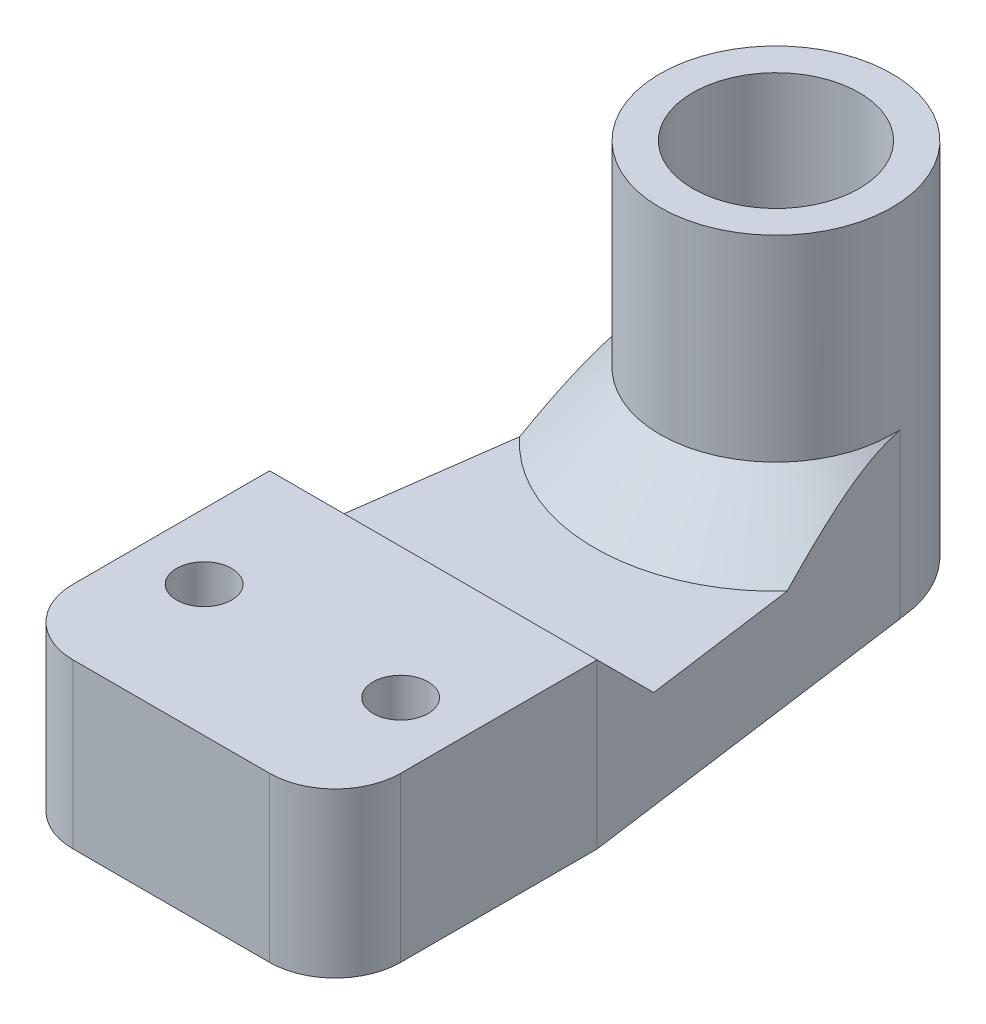
ISO-10303-21;
HEADER;
FILE_DESCRIPTION(('STEP AP214'),'2;1');
FILE_NAME('part.step','',(''),(''),'','','');
FILE_SCHEMA(('AUTOMOTIVE_DESIGN { 1 0 10303 214 1 1 1 1 }'));
ENDSEC;
DATA;
#1=APPLICATION_CONTEXT('core data for automotive mechanical design processes');
#2=APPLICATION_PROTOCOL_DEFINITION('international standard','automotive_design',2000,#1);
#3=PRODUCT_CONTEXT('',#1,'mechanical');
#4=PRODUCT('Part','Part','',(#3));
#5=PRODUCT_RELATED_PRODUCT_CATEGORY('part','',(#4));
#6=PRODUCT_DEFINITION_FORMATION('','',#4);
#7=PRODUCT_DEFINITION_CONTEXT('part definition',#1,'design');
#8=PRODUCT_DEFINITION('design','',#6,#7);
#9=PRODUCT_DEFINITION_SHAPE('','',#8);
#10=(LENGTH_UNIT() NAMED_UNIT(*) SI_UNIT(.MILLI.,.METRE.));
#11=(NAMED_UNIT(*) PLANE_ANGLE_UNIT() SI_UNIT($,.RADIAN.));
#12=(NAMED_UNIT(*) SI_UNIT($,.STERADIAN.) SOLID_ANGLE_UNIT());
#13=UNCERTAINTY_MEASURE_WITH_UNIT(LENGTH_MEASURE(1.E-05),#10,'distance_accuracy_value','');
#14=(GEOMETRIC_REPRESENTATION_CONTEXT(3) GLOBAL_UNCERTAINTY_ASSIGNED_CONTEXT((#13)) GLOBAL_UNIT_ASSIGNED_CONTEXT((#10,
#11,#12)) REPRESENTATION_CONTEXT('',''));
#15=CARTESIAN_POINT('',(0.,0.,0.));
#16=DIRECTION('',(0.,0.,1.));
#17=DIRECTION('',(1.,0.,0.));
#18=AXIS2_PLACEMENT_3D('',#15,#16,#17);
#19=CARTESIAN_POINT('',(0.,0.,0.));
#20=DIRECTION('',(0.,1.,0.));
#21=DIRECTION('',(0.,0.,1.));
#22=AXIS2_PLACEMENT_3D('',#19,#20,#21);
#23=PLANE('',#22);
#24=DIRECTION('',(0.13519099303907,0.,-0.990819557437736));
#25=VECTOR('',#24,1.);
#26=CARTESIAN_POINT('',(-13.6110412414393,0.,-1.85713954464565));
#27=LINE('',#26,#25);
#28=CARTESIAN_POINT('',(-11.8177819713779,0.,-15.));
#29=VERTEX_POINT('',#28);
#30=CARTESIAN_POINT('',(-10.2090289673038,0.,-26.7906075226674));
#31=VERTEX_POINT('',#30);
#32=EDGE_CURVE('E198',#29,#31,#27,.T.);
#33=ORIENTED_EDGE('',*,*,#32,.F.);
#34=DIRECTION('',(1.,0.,0.));
#35=VECTOR('',#34,1.);
#36=CARTESIAN_POINT('',(12.5,0.,-15.));
#37=LINE('',#36,#35);
#38=CARTESIAN_POINT('',(11.8177819713779,0.,-15.));
#39=VERTEX_POINT('',#38);
#40=EDGE_CURVE('E228',#29,#39,#37,.T.);
#41=ORIENTED_EDGE('',*,*,#40,.T.);
#42=DIRECTION('',(-0.135190993039071,0.,-0.990819557437735));
#43=VECTOR('',#42,1.);
#44=CARTESIAN_POINT('',(13.6110412414393,0.,-1.85713954464565));
#45=LINE('',#44,#43);
#46=CARTESIAN_POINT('',(10.2090289673038,0.,-26.7906075226674));
#47=VERTEX_POINT('',#46);
#48=EDGE_CURVE('E161',#39,#47,#45,.T.);
#49=ORIENTED_EDGE('',*,*,#48,.T.);
#50=CARTESIAN_POINT('',(0.,0.,-36.15));
#51=DIRECTION('',(0.,1.,0.));
#52=DIRECTION('',(0.,0.,1.));
#53=AXIS2_PLACEMENT_3D('',#50,#51,#52);
#54=CIRCLE('',#53,13.85);
#55=EDGE_CURVE('E225',#47,#31,#54,.F.);
#56=ORIENTED_EDGE('',*,*,#55,.T.);
#57=EDGE_LOOP('',(#33,#41,#49,#56));
#58=FACE_BOUND('',#57,.T.);
#59=ADVANCED_FACE('F47',(#58),#23,.T.);
#60=CARTESIAN_POINT('',(8.85000000000001,-7.5,0.));
#61=DIRECTION('',(1.,0.,0.));
#62=DIRECTION('',(0.,0.,-1.));
#63=AXIS2_PLACEMENT_3D('',#60,#61,#62);
#64=PLANE('',#63);
#65=DIRECTION('',(0.,1.,0.));
#66=VECTOR('',#65,1.);
#67=CARTESIAN_POINT('',(8.85,-7.5,-36.15));
#68=LINE('',#67,#66);
#69=CARTESIAN_POINT('',(8.85,-7.5,-36.15));
#70=VERTEX_POINT('',#69);
#71=CARTESIAN_POINT('',(8.85,5.00000000000004,-36.15));
#72=VERTEX_POINT('',#71);
#73=EDGE_CURVE('E139',#70,#72,#68,.T.);
#74=ORIENTED_EDGE('',*,*,#73,.T.);
#75=CARTESIAN_POINT('',(8.85,5.00000000000004,-36.15));
#76=CARTESIAN_POINT('',(8.85,4.999993165204,-36.2502781368476));
#77=CARTESIAN_POINT('',(8.85,4.9982912530021,-36.3504987858993));
#78=CARTESIAN_POINT('',(8.85,4.99149727602525,-36.5508250424022));
#79=CARTESIAN_POINT('',(8.85,4.98640521348442,-36.6509306499294));
#80=CARTESIAN_POINT('',(8.85,4.97961807577188,-36.7509787697362));
#81=B_SPLINE_CURVE_WITH_KNOTS('',3,(#75,#76,#77,#78,#79,#80),.UNSPECIFIED.,.F.,.F.,(4,2,4),(0.,
0.300705295951448,0.601410393736025),.UNSPECIFIED.);
#82=CARTESIAN_POINT('',(8.85,4.97961807577188,-36.7509787697362));
#83=VERTEX_POINT('',#82);
#84=EDGE_CURVE('E241',#72,#83,#81,.T.);
#85=ORIENTED_EDGE('',*,*,#84,.T.);
#86=DIRECTION('',(0.,1.,0.));
#87=VECTOR('',#86,1.);
#88=CARTESIAN_POINT('',(8.85,-7.5,-36.7509787697362));
#89=LINE('',#88,#87);
#90=CARTESIAN_POINT('',(8.85,-7.5,-36.7509787697362));
#91=VERTEX_POINT('',#90);
#92=EDGE_CURVE('E157',#91,#83,#89,.T.);
#93=ORIENTED_EDGE('',*,*,#92,.F.);
#94=DIRECTION('',(0.,0.,-1.));
#95=VECTOR('',#94,1.);
#96=CARTESIAN_POINT('',(8.85000000000001,-7.5,0.));
#97=LINE('',#96,#95);
#98=EDGE_CURVE('E155',#70,#91,#97,.T.);
#99=ORIENTED_EDGE('',*,*,#98,.F.);
#100=EDGE_LOOP('',(#74,#85,#93,#99));
#101=FACE_BOUND('',#100,.T.);
#102=ADVANCED_FACE('F156',(#101),#64,.F.);
#103=CARTESIAN_POINT('',(13.6110412414393,-7.5,-1.85713954464565));
#104=DIRECTION('',(0.990819557437735,0.,-0.135190993039071));
#105=DIRECTION('',(-0.135190993039071,0.,-0.990819557437735));
#106=AXIS2_PLACEMENT_3D('',#103,#104,#105);
#107=PLANE('',#106);
#108=ORIENTED_EDGE('',*,*,#48,.F.);
#109=DIRECTION('',(-0.0960342700961743,-0.70383855356434,-0.703838553564348));
#110=VECTOR('',#109,1.);
#111=CARTESIAN_POINT('',(11.7087915195177,-0.798794866799206,-15.7987948667993));
#112=LINE('',#111,#110);
#113=CARTESIAN_POINT('',(12.5,5.,-10.));
#114=VERTEX_POINT('',#113);
#115=EDGE_CURVE('E234',#39,#114,#112,.F.);
#116=ORIENTED_EDGE('',*,*,#115,.T.);
#117=DIRECTION('',(0.,1.,0.));
#118=VECTOR('',#117,1.);
#119=CARTESIAN_POINT('',(12.5,-7.5,-10.));
#120=LINE('',#119,#118);
#121=CARTESIAN_POINT('',(12.5,-7.5,-10.));
#122=VERTEX_POINT('',#121);
#123=EDGE_CURVE('E209',#122,#114,#120,.T.);
#124=ORIENTED_EDGE('',*,*,#123,.F.);
#125=DIRECTION('',(-0.135190993039071,0.,-0.990819557437735));
#126=VECTOR('',#125,1.);
#127=CARTESIAN_POINT('',(13.6110412414393,-7.5,-1.85713954464565));
#128=LINE('',#127,#126);
#129=EDGE_CURVE('E188',#122,#91,#128,.T.);
#130=ORIENTED_EDGE('',*,*,#129,.T.);
#131=ORIENTED_EDGE('',*,*,#92,.T.);
#132=CARTESIAN_POINT('',(8.85,4.97961807577188,-36.7509787697362));
#133=CARTESIAN_POINT('',(8.86952521616639,4.96984985447064,-36.6078777716152));
#134=CARTESIAN_POINT('',(8.88901632843545,4.95655418855607,-36.4650267221609));
#135=CARTESIAN_POINT('',(8.92788726488935,4.92319907208714,-36.1801402575478));
#136=CARTESIAN_POINT('',(8.94726711852058,4.9031415038799,-36.0381046265753));
#137=CARTESIAN_POINT('',(8.98583687606921,4.8566040220541,-35.7554255127842));
#138=CARTESIAN_POINT('',(9.00502712496709,4.83013968670678,-35.6147795015916));
#139=CARTESIAN_POINT('',(9.04323620560288,4.77114222174539,-35.3347438016192));
#140=CARTESIAN_POINT('',(9.06225502569041,4.73860868287692,-35.1953541982255));
#141=CARTESIAN_POINT('',(9.1184640872157,4.63355680832067,-34.7833960032858));
#142=CARTESIAN_POINT('',(9.15537901724246,4.55287240549804,-34.5128451787839));
#143=CARTESIAN_POINT('',(9.2283721994417,4.37286550246867,-33.9778755712915));
#144=CARTESIAN_POINT('',(9.26445004121688,4.27353406846279,-33.7134597961173));
#145=CARTESIAN_POINT('',(9.34072757063575,4.04453011645242,-33.1544190919825));
#146=CARTESIAN_POINT('',(9.38080033336595,3.91255810320771,-32.8607244001906));
#147=CARTESIAN_POINT('',(9.45992034469864,3.63264599769134,-32.2808510458284));
#148=CARTESIAN_POINT('',(9.49896719154791,3.48469976239443,-31.9946753277215));
#149=CARTESIAN_POINT('',(9.57622716368897,3.17576073104443,-31.4284342662159));
#150=CARTESIAN_POINT('',(9.61443793517536,3.01473593913031,-31.1483861739397));
#151=CARTESIAN_POINT('',(9.69003488947677,2.68256330808689,-30.5943334288511));
#152=CARTESIAN_POINT('',(9.72742118330014,2.51141684331428,-30.3203279624543));
#153=CARTESIAN_POINT('',(9.80288342377384,2.15435470082208,-29.7672625397615));
#154=CARTESIAN_POINT('',(9.84093213963402,1.96812539066234,-29.4884021588872));
#155=CARTESIAN_POINT('',(9.91637997961569,1.5885716997897,-28.9354422779086));
#156=CARTESIAN_POINT('',(9.95377904373629,1.39524666880556,-28.6613432175529));
#157=CARTESIAN_POINT('',(10.0277589863378,1.00421553891466,-28.1191416082598));
#158=CARTESIAN_POINT('',(10.0643437625123,0.806549651450251,-27.8510104929886));
#159=CARTESIAN_POINT('',(10.1370284065109,0.406550081628088,-27.3183021728539));
#160=CARTESIAN_POINT('',(10.1731284084791,0.204217734493121,-27.0537239848429));
#161=CARTESIAN_POINT('',(10.2090289673038,0.,-26.7906075226674));
#162=B_SPLINE_CURVE_WITH_KNOTS('',3,(#132,#133,#134,#135,#136,#137,#138,#139,#140,#141,#142,
#143,#144,#145,#146,#147,#148,#149,#150,#151,#152,#153,#154,#155,#156,#157,#158,#159,#160,#161),
.UNSPECIFIED.,.F.,.F.,(4,2,2,2,2,2,2,2,2,2,2,2,2,2,4),(0.,0.434207308821548,0.868293844690426,
1.3013353025838,1.73440597159573,2.58771199176812,3.44142787936809,4.41421394646207,
5.38737544828286,6.36299390951703,7.33848020061623,8.35078532667936,9.36318345592189,
10.368484653598,11.3735016863097),.UNSPECIFIED.);
#163=EDGE_CURVE('E250',#83,#47,#162,.T.);
#164=ORIENTED_EDGE('',*,*,#163,.T.);
#165=EDGE_LOOP('',(#108,#116,#124,#130,#131,#164));
#166=FACE_BOUND('',#165,.T.);
#167=ADVANCED_FACE('F320',(#166),#107,.T.);
#168=CARTESIAN_POINT('',(12.5,-7.5,0.));
#169=DIRECTION('',(1.,0.,0.));
#170=DIRECTION('',(0.,0.,-1.));
#171=AXIS2_PLACEMENT_3D('',#168,#169,#170);
#172=PLANE('',#171);
#173=DIRECTION('',(0.,0.,-1.));
#174=VECTOR('',#173,1.);
#175=CARTESIAN_POINT('',(12.5,5.,0.));
#176=LINE('',#175,#174);
#177=CARTESIAN_POINT('',(12.5,5.,5.));
#178=VERTEX_POINT('',#177);
#179=EDGE_CURVE('E497',#178,#114,#176,.T.);
#180=ORIENTED_EDGE('',*,*,#179,.F.);
#181=DIRECTION('',(0.,1.,0.));
#182=VECTOR('',#181,1.);
#183=CARTESIAN_POINT('',(12.5,-7.5,5.));
#184=LINE('',#183,#182);
#185=CARTESIAN_POINT('',(12.5,-7.5,5.));
#186=VERTEX_POINT('',#185);
#187=EDGE_CURVE('E71',#178,#186,#184,.F.);
#188=ORIENTED_EDGE('',*,*,#187,.T.);
#189=DIRECTION('',(0.,0.,-1.));
#190=VECTOR('',#189,1.);
#191=CARTESIAN_POINT('',(12.5,-7.5,0.));
#192=LINE('',#191,#190);
#193=EDGE_CURVE('E185',#186,#122,#192,.T.);
#194=ORIENTED_EDGE('',*,*,#193,.T.);
#195=ORIENTED_EDGE('',*,*,#123,.T.);
#196=EDGE_LOOP('',(#180,#188,#194,#195));
#197=FACE_BOUND('',#196,.T.);
#198=ADVANCED_FACE('F452',(#197),#172,.T.);
#199=CARTESIAN_POINT('',(0.,-7.5,10.));
#200=DIRECTION('',(0.,0.,1.));
#201=DIRECTION('',(1.,0.,0.));
#202=AXIS2_PLACEMENT_3D('',#199,#200,#201);
#203=PLANE('',#202);
#204=DIRECTION('',(1.,0.,0.));
#205=VECTOR('',#204,1.);
#206=CARTESIAN_POINT('',(0.,-7.5,10.));
#207=LINE('',#206,#205);
#208=CARTESIAN_POINT('',(-7.5,-7.5,10.));
#209=VERTEX_POINT('',#208);
#210=CARTESIAN_POINT('',(7.5,-7.5,10.));
#211=VERTEX_POINT('',#210);
#212=EDGE_CURVE('E181',#209,#211,#207,.T.);
#213=ORIENTED_EDGE('',*,*,#212,.T.);
#214=DIRECTION('',(0.,1.,0.));
#215=VECTOR('',#214,1.);
#216=CARTESIAN_POINT('',(7.5,-7.5,10.));
#217=LINE('',#216,#215);
#218=CARTESIAN_POINT('',(7.5,5.,10.));
#219=VERTEX_POINT('',#218);
#220=EDGE_CURVE('E542',#211,#219,#217,.T.);
#221=ORIENTED_EDGE('',*,*,#220,.T.);
#222=DIRECTION('',(1.,0.,0.));
#223=VECTOR('',#222,1.);
#224=CARTESIAN_POINT('',(0.,5.,10.));
#225=LINE('',#224,#223);
#226=CARTESIAN_POINT('',(-7.5,5.,10.));
#227=VERTEX_POINT('',#226);
#228=EDGE_CURVE('E502',#227,#219,#225,.T.);
#229=ORIENTED_EDGE('',*,*,#228,.F.);
#230=DIRECTION('',(0.,1.,0.));
#231=VECTOR('',#230,1.);
#232=CARTESIAN_POINT('',(-7.5,-7.5,10.));
#233=LINE('',#232,#231);
#234=EDGE_CURVE('E540',#227,#209,#233,.F.);
#235=ORIENTED_EDGE('',*,*,#234,.T.);
#236=EDGE_LOOP('',(#213,#221,#229,#235));
#237=FACE_BOUND('',#236,.T.);
#238=ADVANCED_FACE('F445',(#237),#203,.T.);
#239=CARTESIAN_POINT('',(-12.5,-7.5,0.));
#240=DIRECTION('',(1.,0.,0.));
#241=DIRECTION('',(0.,0.,-1.));
#242=AXIS2_PLACEMENT_3D('',#239,#240,#241);
#243=PLANE('',#242);
#244=DIRECTION('',(0.,0.,-1.));
#245=VECTOR('',#244,1.);
#246=CARTESIAN_POINT('',(-12.5,-7.5,0.));
#247=LINE('',#246,#245);
#248=CARTESIAN_POINT('',(-12.5,-7.5,5.));
#249=VERTEX_POINT('',#248);
#250=CARTESIAN_POINT('',(-12.5,-7.5,-10.));
#251=VERTEX_POINT('',#250);
#252=EDGE_CURVE('E178',#249,#251,#247,.T.);
#253=ORIENTED_EDGE('',*,*,#252,.F.);
#254=DIRECTION('',(0.,1.,0.));
#255=VECTOR('',#254,1.);
#256=CARTESIAN_POINT('',(-12.5,5.,5.));
#257=LINE('',#256,#255);
#258=CARTESIAN_POINT('',(-12.5,5.,5.));
#259=VERTEX_POINT('',#258);
#260=EDGE_CURVE('E11',#249,#259,#257,.T.);
#261=ORIENTED_EDGE('',*,*,#260,.T.);
#262=DIRECTION('',(0.,0.,-1.));
#263=VECTOR('',#262,1.);
#264=CARTESIAN_POINT('',(-12.5,5.,0.));
#265=LINE('',#264,#263);
#266=CARTESIAN_POINT('',(-12.5,4.99999999999998,-10.));
#267=VERTEX_POINT('',#266);
#268=EDGE_CURVE('E202',#259,#267,#265,.T.);
#269=ORIENTED_EDGE('',*,*,#268,.T.);
#270=DIRECTION('',(0.,1.,0.));
#271=VECTOR('',#270,1.);
#272=CARTESIAN_POINT('',(-12.5,-7.5,-10.));
#273=LINE('',#272,#271);
#274=EDGE_CURVE('E213',#251,#267,#273,.T.);
#275=ORIENTED_EDGE('',*,*,#274,.F.);
#276=EDGE_LOOP('',(#253,#261,#269,#275));
#277=FACE_BOUND('',#276,.T.);
#278=ADVANCED_FACE('F294',(#277),#243,.F.);
#279=CARTESIAN_POINT('',(-13.6110412414393,-7.5,-1.85713954464565));
#280=DIRECTION('',(0.990819557437735,0.,0.13519099303907));
#281=DIRECTION('',(0.13519099303907,0.,-0.990819557437736));
#282=AXIS2_PLACEMENT_3D('',#279,#280,#281);
#283=PLANE('',#282);
#284=ORIENTED_EDGE('',*,*,#274,.T.);
#285=DIRECTION('',(-0.096034270096174,0.70383855356434,0.703838553564348));
#286=VECTOR('',#285,1.);
#287=CARTESIAN_POINT('',(-12.215736182696,2.91662045432747,-12.0833795456725));
#288=LINE('',#287,#286);
#289=EDGE_CURVE('E238',#267,#29,#288,.F.);
#290=ORIENTED_EDGE('',*,*,#289,.T.);
#291=ORIENTED_EDGE('',*,*,#32,.T.);
#292=CARTESIAN_POINT('',(-10.2090289673038,0.,-26.7906075226674));
#293=CARTESIAN_POINT('',(-10.1719667494186,0.21082003046292,-27.0622378250805));
#294=CARTESIAN_POINT('',(-10.1346922964825,0.419636550061856,-27.3354236056686));
#295=CARTESIAN_POINT('',(-10.0596230828301,0.832272462849694,-27.8856085209223));
#296=CARTESIAN_POINT('',(-10.0218281571344,1.03609021181526,-28.1626088647274));
#297=CARTESIAN_POINT('',(-9.94532241247762,1.43930626853286,-28.7233221663924));
#298=CARTESIAN_POINT('',(-9.90660653962085,1.6386523000143,-29.0070721644316));
#299=CARTESIAN_POINT('',(-9.82847004404595,2.02960114475368,-29.5797372971072));
#300=CARTESIAN_POINT('',(-9.78904949727667,2.22120478530518,-29.8686518751117));
#301=CARTESIAN_POINT('',(-9.71092855045548,2.58747275761064,-30.4412030504227));
#302=CARTESIAN_POINT('',(-9.67225991741696,2.76250620311102,-30.7246068261674));
#303=CARTESIAN_POINT('',(-9.59402438335674,3.10140975916726,-31.2979978153959));
#304=CARTESIAN_POINT('',(-9.55445733501205,3.26527802096057,-31.5879861086151));
#305=CARTESIAN_POINT('',(-9.4744304231143,3.57836546959044,-32.1745061692134));
#306=CARTESIAN_POINT('',(-9.43397377129329,3.72762925560616,-32.4710143976952));
#307=CARTESIAN_POINT('',(-9.35195006572219,4.00826534109267,-33.0721690295713));
#308=CARTESIAN_POINT('',(-9.31038355311133,4.13964617594109,-33.3768114669371));
#309=CARTESIAN_POINT('',(-9.2349579999634,4.35457752659846,-33.929608006925));
#310=CARTESIAN_POINT('',(-9.20132081600815,4.4423729236317,-34.176136114832));
#311=CARTESIAN_POINT('',(-9.13333241458266,4.60131087605998,-34.6744255074681));
#312=CARTESIAN_POINT('',(-9.09898139834427,4.67245805712626,-34.9261853173618));
#313=CARTESIAN_POINT('',(-9.0467422914763,4.76513394956592,-35.3090475745604));
#314=CARTESIAN_POINT('',(-9.02908349540233,4.79383639917096,-35.438469513978));
#315=CARTESIAN_POINT('',(-8.99362377657189,4.84595998849557,-35.6983550442831));
#316=CARTESIAN_POINT('',(-8.97582286132601,4.86938140541417,-35.8288185801254));
#317=CARTESIAN_POINT('',(-8.94006934843534,4.91069002389312,-36.0908573374629));
#318=CARTESIAN_POINT('',(-8.92211652840569,4.92856672922279,-36.2224341888246));
#319=CARTESIAN_POINT('',(-8.88611880171843,4.95850878395154,-36.486262797693));
#320=CARTESIAN_POINT('',(-8.86807387601962,4.97057287808505,-36.6185146947533));
#321=CARTESIAN_POINT('',(-8.85,4.97961807577188,-36.7509787697363));
#322=B_SPLINE_CURVE_WITH_KNOTS('',3,(#292,#293,#294,#295,#296,#297,#298,#299,#300,#301,#302,
#303,#304,#305,#306,#307,#308,#309,#310,#311,#312,#313,#314,#315,#316,#317,#318,#319,#320,#321),
.UNSPECIFIED.,.F.,.F.,(4,2,2,2,2,2,2,2,2,2,2,2,2,2,4),(0.,1.03752964090692,2.07539609508894,
3.12208246422732,4.16865669499738,5.17446164289494,6.18043273209296,7.18322905917604,
8.18554506926123,8.97662233849651,9.76747954691829,10.168601559327,10.569702512117,
10.9715581856931,11.3735006033729),.UNSPECIFIED.);
#323=CARTESIAN_POINT('',(-8.85,4.97961807577188,-36.7509787697362));
#324=VERTEX_POINT('',#323);
#325=EDGE_CURVE('E274',#31,#324,#322,.T.);
#326=ORIENTED_EDGE('',*,*,#325,.T.);
#327=DIRECTION('',(0.,1.,0.));
#328=VECTOR('',#327,1.);
#329=CARTESIAN_POINT('',(-8.85,-7.5,-36.7509787697362));
#330=LINE('',#329,#328);
#331=CARTESIAN_POINT('',(-8.85,-7.5,-36.7509787697362));
#332=VERTEX_POINT('',#331);
#333=EDGE_CURVE('E217',#332,#324,#330,.T.);
#334=ORIENTED_EDGE('',*,*,#333,.F.);
#335=DIRECTION('',(0.13519099303907,0.,-0.990819557437736));
#336=VECTOR('',#335,1.);
#337=CARTESIAN_POINT('',(-13.6110412414393,-7.5,-1.85713954464565));
#338=LINE('',#337,#336);
#339=EDGE_CURVE('E172',#251,#332,#338,.T.);
#340=ORIENTED_EDGE('',*,*,#339,.F.);
#341=EDGE_LOOP('',(#284,#290,#291,#326,#334,#340));
#342=FACE_BOUND('',#341,.T.);
#343=ADVANCED_FACE('F289',(#342),#283,.F.);
#344=CARTESIAN_POINT('',(-8.85,-7.5,0.));
#345=DIRECTION('',(1.,0.,0.));
#346=DIRECTION('',(0.,0.,-1.));
#347=AXIS2_PLACEMENT_3D('',#344,#345,#346);
#348=PLANE('',#347);
#349=ORIENTED_EDGE('',*,*,#333,.T.);
#350=CARTESIAN_POINT('',(-8.85,4.97961807577188,-36.7509787697362));
#351=CARTESIAN_POINT('',(-8.85,4.98640521348442,-36.6509306499294));
#352=CARTESIAN_POINT('',(-8.85,4.99149727602525,-36.5508250424023));
#353=CARTESIAN_POINT('',(-8.85,4.9982912530021,-36.3504987858993));
#354=CARTESIAN_POINT('',(-8.85,4.999993165204,-36.2502781368477));
#355=CARTESIAN_POINT('',(-8.85,5.00000000000004,-36.15));
#356=B_SPLINE_CURVE_WITH_KNOTS('',3,(#350,#351,#352,#353,#354,#355),.UNSPECIFIED.,.F.,.F.,(4,2,
4),(0.,0.300705097784598,0.601410393736067),.UNSPECIFIED.);
#357=CARTESIAN_POINT('',(-8.85,5.00000000000004,-36.15));
#358=VERTEX_POINT('',#357);
#359=EDGE_CURVE('E282',#324,#358,#356,.T.);
#360=ORIENTED_EDGE('',*,*,#359,.T.);
#361=DIRECTION('',(0.,1.,0.));
#362=VECTOR('',#361,1.);
#363=CARTESIAN_POINT('',(-8.85,-7.5,-36.15));
#364=LINE('',#363,#362);
#365=CARTESIAN_POINT('',(-8.85,-7.5,-36.15));
#366=VERTEX_POINT('',#365);
#367=EDGE_CURVE('E151',#366,#358,#364,.T.);
#368=ORIENTED_EDGE('',*,*,#367,.F.);
#369=DIRECTION('',(0.,0.,-1.));
#370=VECTOR('',#369,1.);
#371=CARTESIAN_POINT('',(-8.85,-7.5,0.));
#372=LINE('',#371,#370);
#373=EDGE_CURVE('E167',#366,#332,#372,.T.);
#374=ORIENTED_EDGE('',*,*,#373,.T.);
#375=EDGE_LOOP('',(#349,#360,#368,#374));
#376=FACE_BOUND('',#375,.T.);
#377=ADVANCED_FACE('F293',(#376),#348,.T.);
#378=CARTESIAN_POINT('',(7.5,-7.5,0.));
#379=DIRECTION('',(0.,1.,0.));
#380=DIRECTION('',(0.,0.,1.));
#381=AXIS2_PLACEMENT_3D('',#378,#379,#380);
#382=CYLINDRICAL_SURFACE('',#381,2.1);
#383=CARTESIAN_POINT('',(7.5,-7.5,0.));
#384=DIRECTION('',(0.,1.,0.));
#385=DIRECTION('',(0.,0.,1.));
#386=AXIS2_PLACEMENT_3D('',#383,#384,#385);
#387=CIRCLE('',#386,2.1);
#388=CARTESIAN_POINT('',(7.5,-7.5,2.1));
#389=VERTEX_POINT('',#388);
#390=EDGE_CURVE('E191',#389,#389,#387,.T.);
#391=ORIENTED_EDGE('',*,*,#390,.F.);
#392=EDGE_LOOP('',(#391));
#393=FACE_BOUND('',#392,.T.);
#394=CARTESIAN_POINT('',(7.5,5.,0.));
#395=DIRECTION('',(0.,1.,0.));
#396=DIRECTION('',(0.,0.,1.));
#397=AXIS2_PLACEMENT_3D('',#394,#395,#396);
#398=CIRCLE('',#397,2.1);
#399=CARTESIAN_POINT('',(7.5,5.,2.1));
#400=VERTEX_POINT('',#399);
#401=EDGE_CURVE('E512',#400,#400,#398,.T.);
#402=ORIENTED_EDGE('',*,*,#401,.T.);
#403=EDGE_LOOP('',(#402));
#404=FACE_BOUND('',#403,.T.);
#405=ADVANCED_FACE('F299',(#393,#404),#382,.F.);
#406=CARTESIAN_POINT('',(0.,-7.5,-36.15));
#407=DIRECTION('',(0.,1.,0.));
#408=DIRECTION('',(0.,0.,1.));
#409=AXIS2_PLACEMENT_3D('',#406,#407,#408);
#410=CYLINDRICAL_SURFACE('',#409,8.85);
#411=CARTESIAN_POINT('',(0.,5.00000000000004,-36.15));
#412=DIRECTION('',(0.,1.,0.));
#413=DIRECTION('',(0.,0.,1.));
#414=AXIS2_PLACEMENT_3D('',#411,#412,#413);
#415=CIRCLE('',#414,8.85);
#416=EDGE_CURVE('E146',#358,#72,#415,.T.);
#417=ORIENTED_EDGE('',*,*,#416,.T.);
#418=ORIENTED_EDGE('',*,*,#73,.F.);
#419=CARTESIAN_POINT('',(0.,-7.5,-36.15));
#420=DIRECTION('',(0.,1.,0.));
#421=DIRECTION('',(0.,0.,1.));
#422=AXIS2_PLACEMENT_3D('',#419,#420,#421);
#423=CIRCLE('',#422,8.85);
#424=EDGE_CURVE('E144',#70,#366,#423,.T.);
#425=ORIENTED_EDGE('',*,*,#424,.T.);
#426=ORIENTED_EDGE('',*,*,#367,.T.);
#427=EDGE_LOOP('',(#417,#418,#425,#426));
#428=FACE_BOUND('',#427,.T.);
#429=CARTESIAN_POINT('',(0.,20.,-36.15));
#430=DIRECTION('',(0.,1.,0.));
#431=DIRECTION('',(0.,0.,1.));
#432=AXIS2_PLACEMENT_3D('',#429,#430,#431);
#433=CIRCLE('',#432,8.85);
#434=CARTESIAN_POINT('',(0.,20.,-27.3));
#435=VERTEX_POINT('',#434);
#436=EDGE_CURVE('E516',#435,#435,#433,.T.);
#437=ORIENTED_EDGE('',*,*,#436,.F.);
#438=EDGE_LOOP('',(#437));
#439=FACE_BOUND('',#438,.T.);
#440=ADVANCED_FACE('F141',(#428,#439),#410,.T.);
#441=CARTESIAN_POINT('',(-7.5,-7.5,0.));
#442=DIRECTION('',(0.,1.,0.));
#443=DIRECTION('',(0.,0.,1.));
#444=AXIS2_PLACEMENT_3D('',#441,#442,#443);
#445=CYLINDRICAL_SURFACE('',#444,2.1);
#446=CARTESIAN_POINT('',(-7.5,-7.5,0.));
#447=DIRECTION('',(0.,1.,0.));
#448=DIRECTION('',(0.,0.,1.));
#449=AXIS2_PLACEMENT_3D('',#446,#447,#448);
#450=CIRCLE('',#449,2.1);
#451=CARTESIAN_POINT('',(-7.5,-7.5,2.1));
#452=VERTEX_POINT('',#451);
#453=EDGE_CURVE('E152',#452,#452,#450,.T.);
#454=ORIENTED_EDGE('',*,*,#453,.F.);
#455=EDGE_LOOP('',(#454));
#456=FACE_BOUND('',#455,.T.);
#457=CARTESIAN_POINT('',(-7.5,5.,0.));
#458=DIRECTION('',(0.,1.,0.));
#459=DIRECTION('',(0.,0.,1.));
#460=AXIS2_PLACEMENT_3D('',#457,#458,#459);
#461=CIRCLE('',#460,2.1);
#462=CARTESIAN_POINT('',(-7.5,5.,2.1));
#463=VERTEX_POINT('',#462);
#464=EDGE_CURVE('E508',#463,#463,#461,.T.);
#465=ORIENTED_EDGE('',*,*,#464,.T.);
#466=EDGE_LOOP('',(#465));
#467=FACE_BOUND('',#466,.T.);
#468=ADVANCED_FACE('F302',(#456,#467),#445,.F.);
#469=CARTESIAN_POINT('',(0.,-7.5,0.));
#470=DIRECTION('',(0.,1.,0.));
#471=DIRECTION('',(0.,0.,1.));
#472=AXIS2_PLACEMENT_3D('',#469,#470,#471);
#473=PLANE('',#472);
#474=ORIENTED_EDGE('',*,*,#193,.F.);
#475=CARTESIAN_POINT('',(7.5,-7.5,5.));
#476=DIRECTION('',(0.,1.,0.));
#477=DIRECTION('',(0.,0.,1.));
#478=AXIS2_PLACEMENT_3D('',#475,#476,#477);
#479=CIRCLE('',#478,5.);
#480=EDGE_CURVE('E56',#186,#211,#479,.F.);
#481=ORIENTED_EDGE('',*,*,#480,.T.);
#482=ORIENTED_EDGE('',*,*,#212,.F.);
#483=CARTESIAN_POINT('',(-7.5,-7.5,5.));
#484=DIRECTION('',(0.,1.,0.));
#485=DIRECTION('',(0.,0.,1.));
#486=AXIS2_PLACEMENT_3D('',#483,#484,#485);
#487=CIRCLE('',#486,5.);
#488=EDGE_CURVE('E63',#209,#249,#487,.F.);
#489=ORIENTED_EDGE('',*,*,#488,.T.);
#490=ORIENTED_EDGE('',*,*,#252,.T.);
#491=ORIENTED_EDGE('',*,*,#339,.T.);
#492=ORIENTED_EDGE('',*,*,#373,.F.);
#493=ORIENTED_EDGE('',*,*,#424,.F.);
#494=ORIENTED_EDGE('',*,*,#98,.T.);
#495=ORIENTED_EDGE('',*,*,#129,.F.);
#496=EDGE_LOOP('',(#474,#481,#482,#489,#490,#491,#492,#493,#494,#495));
#497=FACE_BOUND('',#496,.T.);
#498=ORIENTED_EDGE('',*,*,#390,.T.);
#499=EDGE_LOOP('',(#498));
#500=FACE_BOUND('',#499,.T.);
#501=ORIENTED_EDGE('',*,*,#453,.T.);
#502=EDGE_LOOP('',(#501));
#503=FACE_BOUND('',#502,.T.);
#504=ADVANCED_FACE('F164',(#497,#500,#503),#473,.F.);
#505=CARTESIAN_POINT('',(0.,5.,0.));
#506=DIRECTION('',(0.,1.,0.));
#507=DIRECTION('',(0.,0.,1.));
#508=AXIS2_PLACEMENT_3D('',#505,#506,#507);
#509=PLANE('',#508);
#510=ORIENTED_EDGE('',*,*,#401,.F.);
#511=EDGE_LOOP('',(#510));
#512=FACE_BOUND('',#511,.T.);
#513=ORIENTED_EDGE('',*,*,#464,.F.);
#514=EDGE_LOOP('',(#513));
#515=FACE_BOUND('',#514,.T.);
#516=ORIENTED_EDGE('',*,*,#228,.T.);
#517=CARTESIAN_POINT('',(7.5,5.,5.));
#518=DIRECTION('',(0.,1.,0.));
#519=DIRECTION('',(0.,0.,1.));
#520=AXIS2_PLACEMENT_3D('',#517,#518,#519);
#521=CIRCLE('',#520,5.);
#522=EDGE_CURVE('E536',#219,#178,#521,.T.);
#523=ORIENTED_EDGE('',*,*,#522,.T.);
#524=ORIENTED_EDGE('',*,*,#179,.T.);
#525=DIRECTION('',(1.,0.,0.));
#526=VECTOR('',#525,1.);
#527=CARTESIAN_POINT('',(0.,5.,-10.));
#528=LINE('',#527,#526);
#529=EDGE_CURVE('E493',#267,#114,#528,.T.);
#530=ORIENTED_EDGE('',*,*,#529,.F.);
#531=ORIENTED_EDGE('',*,*,#268,.F.);
#532=CARTESIAN_POINT('',(-7.5,5.,5.));
#533=DIRECTION('',(0.,1.,0.));
#534=DIRECTION('',(0.,0.,1.));
#535=AXIS2_PLACEMENT_3D('',#532,#533,#534);
#536=CIRCLE('',#535,5.);
#537=EDGE_CURVE('E537',#259,#227,#536,.T.);
#538=ORIENTED_EDGE('',*,*,#537,.T.);
#539=EDGE_LOOP('',(#516,#523,#524,#530,#531,#538));
#540=FACE_BOUND('',#539,.T.);
#541=ADVANCED_FACE('F335',(#512,#515,#540),#509,.T.);
#542=CARTESIAN_POINT('',(0.,20.,-36.15));
#543=DIRECTION('',(0.,-1.,0.));
#544=DIRECTION('',(0.,0.,-1.));
#545=AXIS2_PLACEMENT_3D('',#542,#543,#544);
#546=CYLINDRICAL_SURFACE('',#545,6.35);
#547=CARTESIAN_POINT('',(0.,20.,-36.15));
#548=DIRECTION('',(0.,1.,0.));
#549=DIRECTION('',(0.,0.,1.));
#550=AXIS2_PLACEMENT_3D('',#547,#548,#549);
#551=CIRCLE('',#550,6.35);
#552=CARTESIAN_POINT('',(0.,20.,-29.8));
#553=VERTEX_POINT('',#552);
#554=EDGE_CURVE('E520',#553,#553,#551,.T.);
#555=ORIENTED_EDGE('',*,*,#554,.T.);
#556=EDGE_LOOP('',(#555));
#557=FACE_BOUND('',#556,.T.);
#558=CARTESIAN_POINT('',(0.,0.,-36.15));
#559=DIRECTION('',(0.,1.,0.));
#560=DIRECTION('',(0.,0.,1.));
#561=AXIS2_PLACEMENT_3D('',#558,#559,#560);
#562=CIRCLE('',#561,6.35);
#563=CARTESIAN_POINT('',(0.,0.,-29.8));
#564=VERTEX_POINT('',#563);
#565=EDGE_CURVE('E208',#564,#564,#562,.F.);
#566=ORIENTED_EDGE('',*,*,#565,.T.);
#567=EDGE_LOOP('',(#566));
#568=FACE_BOUND('',#567,.T.);
#569=ADVANCED_FACE('F329',(#557,#568),#546,.F.);
#570=CARTESIAN_POINT('',(0.,20.,0.));
#571=DIRECTION('',(0.,1.,0.));
#572=DIRECTION('',(0.,0.,1.));
#573=AXIS2_PLACEMENT_3D('',#570,#571,#572);
#574=PLANE('',#573);
#575=ORIENTED_EDGE('',*,*,#554,.F.);
#576=EDGE_LOOP('',(#575));
#577=FACE_BOUND('',#576,.T.);
#578=ORIENTED_EDGE('',*,*,#436,.T.);
#579=EDGE_LOOP('',(#578));
#580=FACE_BOUND('',#579,.T.);
#581=ADVANCED_FACE('F323',(#577,#580),#574,.T.);
#582=ORIENTED_EDGE('',*,*,#565,.F.);
#583=EDGE_LOOP('',(#582));
#584=FACE_BOUND('',#583,.T.);
#585=ADVANCED_FACE('F315',(#584),#23,.T.);
#586=CARTESIAN_POINT('',(0.,0.,-15.));
#587=DIRECTION('',(0.,0.707106781186552,-0.707106781186544));
#588=DIRECTION('',(-1.,0.,0.));
#589=AXIS2_PLACEMENT_3D('',#586,#587,#588);
#590=PLANE('',#589);
#591=ORIENTED_EDGE('',*,*,#289,.F.);
#592=ORIENTED_EDGE('',*,*,#529,.T.);
#593=ORIENTED_EDGE('',*,*,#115,.F.);
#594=ORIENTED_EDGE('',*,*,#40,.F.);
#595=EDGE_LOOP('',(#591,#592,#593,#594));
#596=FACE_BOUND('',#595,.T.);
#597=ADVANCED_FACE('F268',(#596),#590,.T.);
#598=CARTESIAN_POINT('',(0.,5.00000000000004,-36.15));
#599=DIRECTION('',(0.,-1.,0.));
#600=DIRECTION('',(0.,0.,-1.));
#601=AXIS2_PLACEMENT_3D('',#598,#599,#600);
#602=CONICAL_SURFACE('',#601,8.85,0.785398163397442);
#603=ORIENTED_EDGE('',*,*,#325,.F.);
#604=ORIENTED_EDGE('',*,*,#55,.F.);
#605=ORIENTED_EDGE('',*,*,#163,.F.);
#606=ORIENTED_EDGE('',*,*,#84,.F.);
#607=ORIENTED_EDGE('',*,*,#416,.F.);
#608=ORIENTED_EDGE('',*,*,#359,.F.);
#609=EDGE_LOOP('',(#603,#604,#605,#606,#607,#608));
#610=FACE_BOUND('',#609,.T.);
#611=ADVANCED_FACE('F261',(#610),#602,.T.);
#612=CARTESIAN_POINT('',(7.5,-7.5,5.));
#613=DIRECTION('',(0.,1.,0.));
#614=DIRECTION('',(0.,0.,1.));
#615=AXIS2_PLACEMENT_3D('',#612,#613,#614);
#616=CYLINDRICAL_SURFACE('',#615,5.);
#617=ORIENTED_EDGE('',*,*,#480,.F.);
#618=ORIENTED_EDGE('',*,*,#187,.F.);
#619=ORIENTED_EDGE('',*,*,#522,.F.);
#620=ORIENTED_EDGE('',*,*,#220,.F.);
#621=EDGE_LOOP('',(#617,#618,#619,#620));
#622=FACE_BOUND('',#621,.T.);
#623=ADVANCED_FACE('F267',(#622),#616,.T.);
#624=CARTESIAN_POINT('',(-7.5,-7.5,5.));
#625=DIRECTION('',(0.,-1.,0.));
#626=DIRECTION('',(0.,0.,-1.));
#627=AXIS2_PLACEMENT_3D('',#624,#625,#626);
#628=CYLINDRICAL_SURFACE('',#627,5.);
#629=ORIENTED_EDGE('',*,*,#488,.F.);
#630=ORIENTED_EDGE('',*,*,#234,.F.);
#631=ORIENTED_EDGE('',*,*,#537,.F.);
#632=ORIENTED_EDGE('',*,*,#260,.F.);
#633=EDGE_LOOP('',(#629,#630,#631,#632));
#634=FACE_BOUND('',#633,.T.);
#635=ADVANCED_FACE('F49',(#634),#628,.T.);
#636=CLOSED_SHELL('',(#59,#102,#167,#198,#238,#278,#343,#377,#405,#440,#468,#504,#541,#569,#581,
#585,#597,#611,#623,#635));
#637=MANIFOLD_SOLID_BREP('B2',#636);
#638=ADVANCED_BREP_SHAPE_REPRESENTATION('',(#18,#637),#14);
#639=SHAPE_DEFINITION_REPRESENTATION(#9,#638);
ENDSEC;
END-ISO-10303-21;
